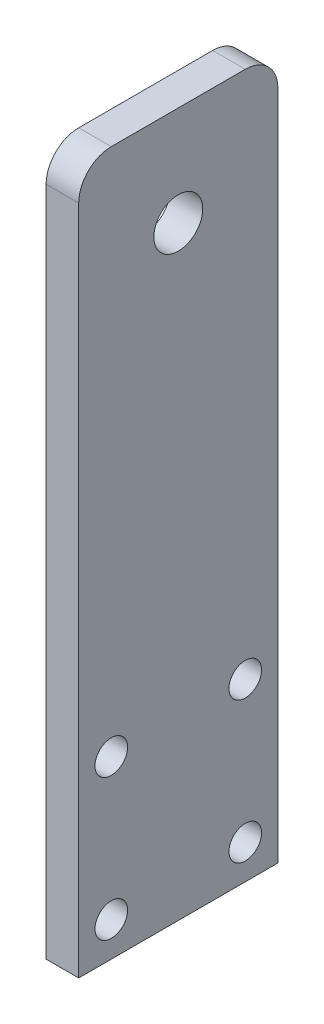
ISO-10303-21;
HEADER;
FILE_DESCRIPTION(('STEP AP214'),'2;1');
FILE_NAME('part.step','',(''),(''),'','','');
FILE_SCHEMA(('AUTOMOTIVE_DESIGN { 1 0 10303 214 1 1 1 1 }'));
ENDSEC;
DATA;
#1=APPLICATION_CONTEXT('core data for automotive mechanical design processes');
#2=APPLICATION_PROTOCOL_DEFINITION('international standard','automotive_design',2000,#1);
#3=PRODUCT_CONTEXT('',#1,'mechanical');
#4=PRODUCT('Part','Part','',(#3));
#5=PRODUCT_RELATED_PRODUCT_CATEGORY('part','',(#4));
#6=PRODUCT_DEFINITION_FORMATION('','',#4);
#7=PRODUCT_DEFINITION_CONTEXT('part definition',#1,'design');
#8=PRODUCT_DEFINITION('design','',#6,#7);
#9=PRODUCT_DEFINITION_SHAPE('','',#8);
#10=(LENGTH_UNIT() NAMED_UNIT(*) SI_UNIT(.MILLI.,.METRE.));
#11=(NAMED_UNIT(*) PLANE_ANGLE_UNIT() SI_UNIT($,.RADIAN.));
#12=(NAMED_UNIT(*) SI_UNIT($,.STERADIAN.) SOLID_ANGLE_UNIT());
#13=UNCERTAINTY_MEASURE_WITH_UNIT(LENGTH_MEASURE(1.E-05),#10,'distance_accuracy_value','');
#14=(GEOMETRIC_REPRESENTATION_CONTEXT(3) GLOBAL_UNCERTAINTY_ASSIGNED_CONTEXT((#13)) GLOBAL_UNIT_ASSIGNED_CONTEXT((#10,
#11,#12)) REPRESENTATION_CONTEXT('',''));
#15=CARTESIAN_POINT('',(0.,0.,0.));
#16=DIRECTION('',(0.,0.,1.));
#17=DIRECTION('',(1.,0.,0.));
#18=AXIS2_PLACEMENT_3D('',#15,#16,#17);
#19=CARTESIAN_POINT('',(6.35,0.,19.3999999999999));
#20=DIRECTION('',(0.,0.,-1.));
#21=DIRECTION('',(-1.,0.,0.));
#22=AXIS2_PLACEMENT_3D('',#19,#20,#21);
#23=PLANE('',#22);
#24=DIRECTION('',(0.,-1.,0.));
#25=VECTOR('',#24,1.);
#26=CARTESIAN_POINT('',(6.35,0.,19.3999999999999));
#27=LINE('',#26,#25);
#28=CARTESIAN_POINT('',(6.35,110.296455088614,19.3999999999999));
#29=VERTEX_POINT('',#28);
#30=CARTESIAN_POINT('',(6.35,-20.4390625,19.3999999999999));
#31=VERTEX_POINT('',#30);
#32=EDGE_CURVE('E88',#29,#31,#27,.T.);
#33=ORIENTED_EDGE('',*,*,#32,.F.);
#34=DIRECTION('',(-1.,0.,0.));
#35=VECTOR('',#34,1.);
#36=CARTESIAN_POINT('',(6.35,110.296455088614,19.3999999999999));
#37=LINE('',#36,#35);
#38=CARTESIAN_POINT('',(0.,110.296455088614,19.3999999999999));
#39=VERTEX_POINT('',#38);
#40=EDGE_CURVE('E113',#29,#39,#37,.T.);
#41=ORIENTED_EDGE('',*,*,#40,.T.);
#42=DIRECTION('',(0.,-1.,0.));
#43=VECTOR('',#42,1.);
#44=CARTESIAN_POINT('',(0.,0.,19.3999999999999));
#45=LINE('',#44,#43);
#46=CARTESIAN_POINT('',(0.,-20.4390625,19.3999999999999));
#47=VERTEX_POINT('',#46);
#48=EDGE_CURVE('E111',#39,#47,#45,.T.);
#49=ORIENTED_EDGE('',*,*,#48,.T.);
#50=DIRECTION('',(-1.,0.,0.));
#51=VECTOR('',#50,1.);
#52=CARTESIAN_POINT('',(6.35,-20.4390625,19.3999999999999));
#53=LINE('',#52,#51);
#54=EDGE_CURVE('E105',#31,#47,#53,.T.);
#55=ORIENTED_EDGE('',*,*,#54,.F.);
#56=EDGE_LOOP('',(#33,#41,#49,#55));
#57=FACE_BOUND('',#56,.T.);
#58=ADVANCED_FACE('F34',(#57),#23,.F.);
#59=CARTESIAN_POINT('',(6.35,-20.4390625,0.));
#60=DIRECTION('',(0.,1.,0.));
#61=DIRECTION('',(0.,0.,1.));
#62=AXIS2_PLACEMENT_3D('',#59,#60,#61);
#63=PLANE('',#62);
#64=DIRECTION('',(0.,0.,-1.));
#65=VECTOR('',#64,1.);
#66=CARTESIAN_POINT('',(0.,-20.4390625,0.));
#67=LINE('',#66,#65);
#68=CARTESIAN_POINT('',(0.,-20.4390625,-19.4));
#69=VERTEX_POINT('',#68);
#70=EDGE_CURVE('E143',#47,#69,#67,.T.);
#71=ORIENTED_EDGE('',*,*,#70,.T.);
#72=DIRECTION('',(-1.,0.,0.));
#73=VECTOR('',#72,1.);
#74=CARTESIAN_POINT('',(6.35,-20.4390625,-19.4));
#75=LINE('',#74,#73);
#76=CARTESIAN_POINT('',(6.35,-20.4390625,-19.4));
#77=VERTEX_POINT('',#76);
#78=EDGE_CURVE('E107',#77,#69,#75,.T.);
#79=ORIENTED_EDGE('',*,*,#78,.F.);
#80=DIRECTION('',(0.,0.,-1.));
#81=VECTOR('',#80,1.);
#82=CARTESIAN_POINT('',(6.35,-20.4390625,0.));
#83=LINE('',#82,#81);
#84=EDGE_CURVE('E92',#31,#77,#83,.T.);
#85=ORIENTED_EDGE('',*,*,#84,.F.);
#86=ORIENTED_EDGE('',*,*,#54,.T.);
#87=EDGE_LOOP('',(#71,#79,#85,#86));
#88=FACE_BOUND('',#87,.T.);
#89=ADVANCED_FACE('F104',(#88),#63,.F.);
#90=CARTESIAN_POINT('',(6.35,0.,-19.3999999999999));
#91=DIRECTION('',(0.,0.,-1.));
#92=DIRECTION('',(0.,1.,0.));
#93=AXIS2_PLACEMENT_3D('',#90,#91,#92);
#94=PLANE('',#93);
#95=DIRECTION('',(0.,-1.,0.));
#96=VECTOR('',#95,1.);
#97=CARTESIAN_POINT('',(0.,0.,-19.3999999999999));
#98=LINE('',#97,#96);
#99=CARTESIAN_POINT('',(0.,110.296455088614,-19.4));
#100=VERTEX_POINT('',#99);
#101=EDGE_CURVE('E140',#100,#69,#98,.T.);
#102=ORIENTED_EDGE('',*,*,#101,.F.);
#103=DIRECTION('',(-1.,0.,0.));
#104=VECTOR('',#103,1.);
#105=CARTESIAN_POINT('',(6.35,110.296455088614,-19.4));
#106=LINE('',#105,#104);
#107=CARTESIAN_POINT('',(6.35,110.296455088614,-19.4));
#108=VERTEX_POINT('',#107);
#109=EDGE_CURVE('E11',#100,#108,#106,.F.);
#110=ORIENTED_EDGE('',*,*,#109,.T.);
#111=DIRECTION('',(0.,-1.,0.));
#112=VECTOR('',#111,1.);
#113=CARTESIAN_POINT('',(6.35,0.,-19.3999999999999));
#114=LINE('',#113,#112);
#115=EDGE_CURVE('E108',#108,#77,#114,.T.);
#116=ORIENTED_EDGE('',*,*,#115,.T.);
#117=ORIENTED_EDGE('',*,*,#78,.T.);
#118=EDGE_LOOP('',(#102,#110,#116,#117));
#119=FACE_BOUND('',#118,.T.);
#120=ADVANCED_FACE('F142',(#119),#94,.T.);
#121=CARTESIAN_POINT('',(6.35,13.7489569909794,-13.05));
#122=DIRECTION('',(-1.,0.,0.));
#123=DIRECTION('',(0.,0.,1.));
#124=AXIS2_PLACEMENT_3D('',#121,#122,#123);
#125=CYLINDRICAL_SURFACE('',#124,3.175);
#126=CARTESIAN_POINT('',(6.35,13.7489569909794,-13.05));
#127=DIRECTION('',(1.,0.,0.));
#128=DIRECTION('',(0.,0.,-1.));
#129=AXIS2_PLACEMENT_3D('',#126,#127,#128);
#130=CIRCLE('',#129,3.175);
#131=CARTESIAN_POINT('',(6.35,13.7489569909794,-16.225));
#132=VERTEX_POINT('',#131);
#133=EDGE_CURVE('E194',#132,#132,#130,.T.);
#134=ORIENTED_EDGE('',*,*,#133,.T.);
#135=EDGE_LOOP('',(#134));
#136=FACE_BOUND('',#135,.T.);
#137=CARTESIAN_POINT('',(0.,13.7489569909794,-13.05));
#138=DIRECTION('',(1.,0.,0.));
#139=DIRECTION('',(0.,0.,-1.));
#140=AXIS2_PLACEMENT_3D('',#137,#138,#139);
#141=CIRCLE('',#140,3.175);
#142=CARTESIAN_POINT('',(0.,13.7489569909794,-16.225));
#143=VERTEX_POINT('',#142);
#144=EDGE_CURVE('E158',#143,#143,#141,.T.);
#145=ORIENTED_EDGE('',*,*,#144,.F.);
#146=EDGE_LOOP('',(#145));
#147=FACE_BOUND('',#146,.T.);
#148=ADVANCED_FACE('F217',(#136,#147),#125,.F.);
#149=CARTESIAN_POINT('',(6.35,-13.7489569909794,13.0499999999999));
#150=DIRECTION('',(-1.,0.,0.));
#151=DIRECTION('',(0.,0.,1.));
#152=AXIS2_PLACEMENT_3D('',#149,#150,#151);
#153=CYLINDRICAL_SURFACE('',#152,3.175);
#154=CARTESIAN_POINT('',(6.35,-13.7489569909794,13.0499999999999));
#155=DIRECTION('',(1.,0.,0.));
#156=DIRECTION('',(0.,0.,-1.));
#157=AXIS2_PLACEMENT_3D('',#154,#155,#156);
#158=CIRCLE('',#157,3.175);
#159=CARTESIAN_POINT('',(6.35,-13.7489569909794,9.87499999999994));
#160=VERTEX_POINT('',#159);
#161=EDGE_CURVE('E197',#160,#160,#158,.T.);
#162=ORIENTED_EDGE('',*,*,#161,.T.);
#163=EDGE_LOOP('',(#162));
#164=FACE_BOUND('',#163,.T.);
#165=CARTESIAN_POINT('',(0.,-13.7489569909794,13.0499999999999));
#166=DIRECTION('',(1.,0.,0.));
#167=DIRECTION('',(0.,0.,-1.));
#168=AXIS2_PLACEMENT_3D('',#165,#166,#167);
#169=CIRCLE('',#168,3.175);
#170=CARTESIAN_POINT('',(0.,-13.7489569909794,9.87499999999994));
#171=VERTEX_POINT('',#170);
#172=EDGE_CURVE('E155',#171,#171,#169,.T.);
#173=ORIENTED_EDGE('',*,*,#172,.F.);
#174=EDGE_LOOP('',(#173));
#175=FACE_BOUND('',#174,.T.);
#176=ADVANCED_FACE('F220',(#164,#175),#153,.F.);
#177=CARTESIAN_POINT('',(6.35,-13.7489569909794,-13.05));
#178=DIRECTION('',(-1.,0.,0.));
#179=DIRECTION('',(0.,0.,1.));
#180=AXIS2_PLACEMENT_3D('',#177,#178,#179);
#181=CYLINDRICAL_SURFACE('',#180,3.175);
#182=CARTESIAN_POINT('',(6.35,-13.7489569909794,-13.05));
#183=DIRECTION('',(1.,0.,0.));
#184=DIRECTION('',(0.,0.,-1.));
#185=AXIS2_PLACEMENT_3D('',#182,#183,#184);
#186=CIRCLE('',#185,3.175);
#187=CARTESIAN_POINT('',(6.35,-13.7489569909794,-16.225));
#188=VERTEX_POINT('',#187);
#189=EDGE_CURVE('E200',#188,#188,#186,.T.);
#190=ORIENTED_EDGE('',*,*,#189,.T.);
#191=EDGE_LOOP('',(#190));
#192=FACE_BOUND('',#191,.T.);
#193=CARTESIAN_POINT('',(0.,-13.7489569909794,-13.05));
#194=DIRECTION('',(1.,0.,0.));
#195=DIRECTION('',(0.,0.,-1.));
#196=AXIS2_PLACEMENT_3D('',#193,#194,#195);
#197=CIRCLE('',#196,3.175);
#198=CARTESIAN_POINT('',(0.,-13.7489569909794,-16.225));
#199=VERTEX_POINT('',#198);
#200=EDGE_CURVE('E152',#199,#199,#197,.T.);
#201=ORIENTED_EDGE('',*,*,#200,.F.);
#202=EDGE_LOOP('',(#201));
#203=FACE_BOUND('',#202,.T.);
#204=ADVANCED_FACE('F227',(#192,#203),#181,.F.);
#205=CARTESIAN_POINT('',(6.35,97.246455088614,0.));
#206=DIRECTION('',(-1.,0.,0.));
#207=DIRECTION('',(0.,0.,1.));
#208=AXIS2_PLACEMENT_3D('',#205,#206,#207);
#209=CYLINDRICAL_SURFACE('',#208,4.76250000151905);
#210=CARTESIAN_POINT('',(6.35,97.246455088614,0.));
#211=DIRECTION('',(1.,0.,0.));
#212=DIRECTION('',(0.,0.,-1.));
#213=AXIS2_PLACEMENT_3D('',#210,#211,#212);
#214=CIRCLE('',#213,4.76250000151905);
#215=CARTESIAN_POINT('',(6.35,97.246455088614,-4.76250000151905));
#216=VERTEX_POINT('',#215);
#217=EDGE_CURVE('E135',#216,#216,#214,.T.);
#218=ORIENTED_EDGE('',*,*,#217,.T.);
#219=EDGE_LOOP('',(#218));
#220=FACE_BOUND('',#219,.T.);
#221=CARTESIAN_POINT('',(0.,97.246455088614,0.));
#222=DIRECTION('',(1.,0.,0.));
#223=DIRECTION('',(0.,0.,-1.));
#224=AXIS2_PLACEMENT_3D('',#221,#222,#223);
#225=CIRCLE('',#224,4.76250000151905);
#226=CARTESIAN_POINT('',(0.,97.246455088614,-4.76250000151905));
#227=VERTEX_POINT('',#226);
#228=EDGE_CURVE('E145',#227,#227,#225,.T.);
#229=ORIENTED_EDGE('',*,*,#228,.F.);
#230=EDGE_LOOP('',(#229));
#231=FACE_BOUND('',#230,.T.);
#232=ADVANCED_FACE('F173',(#220,#231),#209,.F.);
#233=CARTESIAN_POINT('',(6.35,116.646455088614,0.));
#234=DIRECTION('',(0.,-1.,0.));
#235=DIRECTION('',(0.,0.,-1.));
#236=AXIS2_PLACEMENT_3D('',#233,#234,#235);
#237=PLANE('',#236);
#238=DIRECTION('',(0.,0.,1.));
#239=VECTOR('',#238,1.);
#240=CARTESIAN_POINT('',(0.,116.646455088614,0.));
#241=LINE('',#240,#239);
#242=CARTESIAN_POINT('',(0.,116.646455088614,-13.05));
#243=VERTEX_POINT('',#242);
#244=CARTESIAN_POINT('',(0.,116.646455088614,13.0499999999999));
#245=VERTEX_POINT('',#244);
#246=EDGE_CURVE('E141',#243,#245,#241,.T.);
#247=ORIENTED_EDGE('',*,*,#246,.T.);
#248=DIRECTION('',(-1.,0.,0.));
#249=VECTOR('',#248,1.);
#250=CARTESIAN_POINT('',(6.35,116.646455088614,13.0499999999999));
#251=LINE('',#250,#249);
#252=CARTESIAN_POINT('',(6.35,116.646455088614,13.0499999999999));
#253=VERTEX_POINT('',#252);
#254=EDGE_CURVE('E55',#245,#253,#251,.F.);
#255=ORIENTED_EDGE('',*,*,#254,.T.);
#256=DIRECTION('',(0.,0.,1.));
#257=VECTOR('',#256,1.);
#258=CARTESIAN_POINT('',(6.35,116.646455088614,0.));
#259=LINE('',#258,#257);
#260=CARTESIAN_POINT('',(6.35,116.646455088614,-13.05));
#261=VERTEX_POINT('',#260);
#262=EDGE_CURVE('E130',#261,#253,#259,.T.);
#263=ORIENTED_EDGE('',*,*,#262,.F.);
#264=DIRECTION('',(-1.,0.,0.));
#265=VECTOR('',#264,1.);
#266=CARTESIAN_POINT('',(0.,116.646455088614,-13.05));
#267=LINE('',#266,#265);
#268=EDGE_CURVE('E124',#261,#243,#267,.T.);
#269=ORIENTED_EDGE('',*,*,#268,.T.);
#270=EDGE_LOOP('',(#247,#255,#263,#269));
#271=FACE_BOUND('',#270,.T.);
#272=ADVANCED_FACE('F133',(#271),#237,.F.);
#273=CARTESIAN_POINT('',(6.35,13.7489569909794,13.0499999999999));
#274=DIRECTION('',(-1.,0.,0.));
#275=DIRECTION('',(0.,0.,1.));
#276=AXIS2_PLACEMENT_3D('',#273,#274,#275);
#277=CYLINDRICAL_SURFACE('',#276,3.175);
#278=CARTESIAN_POINT('',(6.35,13.7489569909794,13.0499999999999));
#279=DIRECTION('',(1.,0.,0.));
#280=DIRECTION('',(0.,0.,-1.));
#281=AXIS2_PLACEMENT_3D('',#278,#279,#280);
#282=CIRCLE('',#281,3.175);
#283=CARTESIAN_POINT('',(6.35,13.7489569909794,9.87499999999994));
#284=VERTEX_POINT('',#283);
#285=EDGE_CURVE('E117',#284,#284,#282,.T.);
#286=ORIENTED_EDGE('',*,*,#285,.T.);
#287=EDGE_LOOP('',(#286));
#288=FACE_BOUND('',#287,.T.);
#289=CARTESIAN_POINT('',(0.,13.7489569909794,13.0499999999999));
#290=DIRECTION('',(1.,0.,0.));
#291=DIRECTION('',(0.,0.,-1.));
#292=AXIS2_PLACEMENT_3D('',#289,#290,#291);
#293=CIRCLE('',#292,3.175);
#294=CARTESIAN_POINT('',(0.,13.7489569909794,9.87499999999994));
#295=VERTEX_POINT('',#294);
#296=EDGE_CURVE('E99',#295,#295,#293,.T.);
#297=ORIENTED_EDGE('',*,*,#296,.F.);
#298=EDGE_LOOP('',(#297));
#299=FACE_BOUND('',#298,.T.);
#300=ADVANCED_FACE('F164',(#288,#299),#277,.F.);
#301=CARTESIAN_POINT('',(6.35,0.,0.));
#302=DIRECTION('',(1.,0.,0.));
#303=DIRECTION('',(0.,0.,-1.));
#304=AXIS2_PLACEMENT_3D('',#301,#302,#303);
#305=PLANE('',#304);
#306=ORIENTED_EDGE('',*,*,#262,.T.);
#307=CARTESIAN_POINT('',(6.35,110.296455088614,13.0499999999999));
#308=DIRECTION('',(1.,0.,0.));
#309=DIRECTION('',(0.,0.,-1.));
#310=AXIS2_PLACEMENT_3D('',#307,#308,#309);
#311=CIRCLE('',#310,6.35);
#312=EDGE_CURVE('E42',#253,#29,#311,.T.);
#313=ORIENTED_EDGE('',*,*,#312,.T.);
#314=ORIENTED_EDGE('',*,*,#32,.T.);
#315=ORIENTED_EDGE('',*,*,#84,.T.);
#316=ORIENTED_EDGE('',*,*,#115,.F.);
#317=CARTESIAN_POINT('',(6.35,110.296455088614,-13.05));
#318=DIRECTION('',(1.,0.,0.));
#319=DIRECTION('',(0.,0.,-1.));
#320=AXIS2_PLACEMENT_3D('',#317,#318,#319);
#321=CIRCLE('',#320,6.35);
#322=EDGE_CURVE('E128',#108,#261,#321,.T.);
#323=ORIENTED_EDGE('',*,*,#322,.T.);
#324=EDGE_LOOP('',(#306,#313,#314,#315,#316,#323));
#325=FACE_BOUND('',#324,.T.);
#326=ORIENTED_EDGE('',*,*,#217,.F.);
#327=EDGE_LOOP('',(#326));
#328=FACE_BOUND('',#327,.T.);
#329=ORIENTED_EDGE('',*,*,#189,.F.);
#330=EDGE_LOOP('',(#329));
#331=FACE_BOUND('',#330,.T.);
#332=ORIENTED_EDGE('',*,*,#161,.F.);
#333=EDGE_LOOP('',(#332));
#334=FACE_BOUND('',#333,.T.);
#335=ORIENTED_EDGE('',*,*,#133,.F.);
#336=EDGE_LOOP('',(#335));
#337=FACE_BOUND('',#336,.T.);
#338=ORIENTED_EDGE('',*,*,#285,.F.);
#339=EDGE_LOOP('',(#338));
#340=FACE_BOUND('',#339,.T.);
#341=ADVANCED_FACE('F90',(#325,#328,#331,#334,#337,#340),#305,.T.);
#342=CARTESIAN_POINT('',(0.,0.,0.));
#343=DIRECTION('',(1.,0.,0.));
#344=DIRECTION('',(0.,0.,-1.));
#345=AXIS2_PLACEMENT_3D('',#342,#343,#344);
#346=PLANE('',#345);
#347=ORIENTED_EDGE('',*,*,#48,.F.);
#348=CARTESIAN_POINT('',(0.,110.296455088614,13.0499999999999));
#349=DIRECTION('',(1.,0.,0.));
#350=DIRECTION('',(0.,0.,-1.));
#351=AXIS2_PLACEMENT_3D('',#348,#349,#350);
#352=CIRCLE('',#351,6.35);
#353=EDGE_CURVE('E122',#39,#245,#352,.F.);
#354=ORIENTED_EDGE('',*,*,#353,.T.);
#355=ORIENTED_EDGE('',*,*,#246,.F.);
#356=CARTESIAN_POINT('',(0.,110.296455088614,-13.05));
#357=DIRECTION('',(1.,0.,0.));
#358=DIRECTION('',(0.,0.,-1.));
#359=AXIS2_PLACEMENT_3D('',#356,#357,#358);
#360=CIRCLE('',#359,6.35);
#361=EDGE_CURVE('E115',#243,#100,#360,.F.);
#362=ORIENTED_EDGE('',*,*,#361,.T.);
#363=ORIENTED_EDGE('',*,*,#101,.T.);
#364=ORIENTED_EDGE('',*,*,#70,.F.);
#365=EDGE_LOOP('',(#347,#354,#355,#362,#363,#364));
#366=FACE_BOUND('',#365,.T.);
#367=ORIENTED_EDGE('',*,*,#228,.T.);
#368=EDGE_LOOP('',(#367));
#369=FACE_BOUND('',#368,.T.);
#370=ORIENTED_EDGE('',*,*,#200,.T.);
#371=EDGE_LOOP('',(#370));
#372=FACE_BOUND('',#371,.T.);
#373=ORIENTED_EDGE('',*,*,#172,.T.);
#374=EDGE_LOOP('',(#373));
#375=FACE_BOUND('',#374,.T.);
#376=ORIENTED_EDGE('',*,*,#144,.T.);
#377=EDGE_LOOP('',(#376));
#378=FACE_BOUND('',#377,.T.);
#379=ORIENTED_EDGE('',*,*,#296,.T.);
#380=EDGE_LOOP('',(#379));
#381=FACE_BOUND('',#380,.T.);
#382=ADVANCED_FACE('F138',(#366,#369,#372,#375,#378,#381),#346,.F.);
#383=CARTESIAN_POINT('',(6.35,110.296455088614,13.0499999999999));
#384=DIRECTION('',(-1.,0.,0.));
#385=DIRECTION('',(0.,0.,1.));
#386=AXIS2_PLACEMENT_3D('',#383,#384,#385);
#387=CYLINDRICAL_SURFACE('',#386,6.35);
#388=ORIENTED_EDGE('',*,*,#312,.F.);
#389=ORIENTED_EDGE('',*,*,#254,.F.);
#390=ORIENTED_EDGE('',*,*,#353,.F.);
#391=ORIENTED_EDGE('',*,*,#40,.F.);
#392=EDGE_LOOP('',(#388,#389,#390,#391));
#393=FACE_BOUND('',#392,.T.);
#394=ADVANCED_FACE('F185',(#393),#387,.T.);
#395=CARTESIAN_POINT('',(6.35,110.296455088614,-13.05));
#396=DIRECTION('',(1.,0.,0.));
#397=DIRECTION('',(0.,0.,-1.));
#398=AXIS2_PLACEMENT_3D('',#395,#396,#397);
#399=CYLINDRICAL_SURFACE('',#398,6.35);
#400=ORIENTED_EDGE('',*,*,#322,.F.);
#401=ORIENTED_EDGE('',*,*,#109,.F.);
#402=ORIENTED_EDGE('',*,*,#361,.F.);
#403=ORIENTED_EDGE('',*,*,#268,.F.);
#404=EDGE_LOOP('',(#400,#401,#402,#403));
#405=FACE_BOUND('',#404,.T.);
#406=ADVANCED_FACE('F36',(#405),#399,.T.);
#407=CLOSED_SHELL('',(#58,#89,#120,#148,#176,#204,#232,#272,#300,#341,#382,#394,#406));
#408=MANIFOLD_SOLID_BREP('B2',#407);
#409=ADVANCED_BREP_SHAPE_REPRESENTATION('',(#18,#408),#14);
#410=SHAPE_DEFINITION_REPRESENTATION(#9,#409);
ENDSEC;
END-ISO-10303-21;
